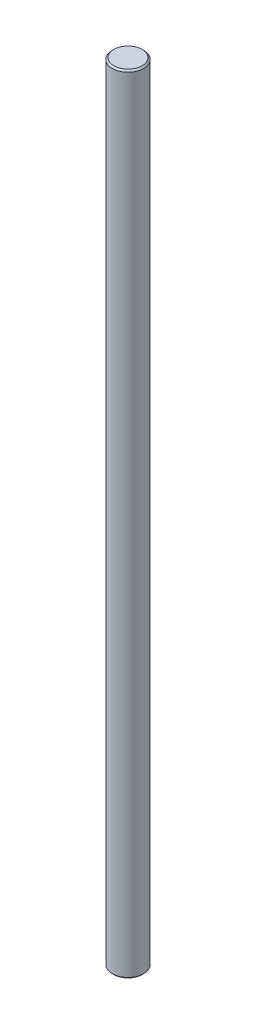
ISO-10303-21;
HEADER;
FILE_DESCRIPTION(('STEP AP214'),'2;1');
FILE_NAME('part.step','',(''),(''),'','','');
FILE_SCHEMA(('AUTOMOTIVE_DESIGN { 1 0 10303 214 1 1 1 1 }'));
ENDSEC;
DATA;
#1=APPLICATION_CONTEXT('core data for automotive mechanical design processes');
#2=APPLICATION_PROTOCOL_DEFINITION('international standard','automotive_design',2000,#1);
#3=PRODUCT_CONTEXT('',#1,'mechanical');
#4=PRODUCT('Part','Part','',(#3));
#5=PRODUCT_RELATED_PRODUCT_CATEGORY('part','',(#4));
#6=PRODUCT_DEFINITION_FORMATION('','',#4);
#7=PRODUCT_DEFINITION_CONTEXT('part definition',#1,'design');
#8=PRODUCT_DEFINITION('design','',#6,#7);
#9=PRODUCT_DEFINITION_SHAPE('','',#8);
#10=(LENGTH_UNIT() NAMED_UNIT(*) SI_UNIT(.MILLI.,.METRE.));
#11=(NAMED_UNIT(*) PLANE_ANGLE_UNIT() SI_UNIT($,.RADIAN.));
#12=(NAMED_UNIT(*) SI_UNIT($,.STERADIAN.) SOLID_ANGLE_UNIT());
#13=UNCERTAINTY_MEASURE_WITH_UNIT(LENGTH_MEASURE(1.E-05),#10,'distance_accuracy_value','');
#14=(GEOMETRIC_REPRESENTATION_CONTEXT(3) GLOBAL_UNCERTAINTY_ASSIGNED_CONTEXT((#13)) GLOBAL_UNIT_ASSIGNED_CONTEXT((#10,
#11,#12)) REPRESENTATION_CONTEXT('',''));
#15=CARTESIAN_POINT('',(0.,0.,0.));
#16=DIRECTION('',(0.,0.,1.));
#17=DIRECTION('',(1.,0.,0.));
#18=AXIS2_PLACEMENT_3D('',#15,#16,#17);
#19=CARTESIAN_POINT('',(0.,500.,0.));
#20=DIRECTION('',(0.,-1.,0.));
#21=DIRECTION('',(0.,0.,-1.));
#22=AXIS2_PLACEMENT_3D('',#19,#20,#21);
#23=CYLINDRICAL_SURFACE('',#22,10.);
#24=CARTESIAN_POINT('',(0.,499.,0.));
#25=DIRECTION('',(0.,1.,0.));
#26=DIRECTION('',(0.,0.,1.));
#27=AXIS2_PLACEMENT_3D('',#24,#25,#26);
#28=CIRCLE('',#27,10.);
#29=CARTESIAN_POINT('',(0.,499.,10.));
#30=VERTEX_POINT('',#29);
#31=EDGE_CURVE('E38',#30,#30,#28,.F.);
#32=ORIENTED_EDGE('',*,*,#31,.T.);
#33=EDGE_LOOP('',(#32));
#34=FACE_BOUND('',#33,.T.);
#35=CARTESIAN_POINT('',(0.,1.,0.));
#36=DIRECTION('',(0.,1.,0.));
#37=DIRECTION('',(0.,0.,1.));
#38=AXIS2_PLACEMENT_3D('',#35,#36,#37);
#39=CIRCLE('',#38,10.);
#40=CARTESIAN_POINT('',(0.,1.,10.));
#41=VERTEX_POINT('',#40);
#42=EDGE_CURVE('E42',#41,#41,#39,.T.);
#43=ORIENTED_EDGE('',*,*,#42,.T.);
#44=EDGE_LOOP('',(#43));
#45=FACE_BOUND('',#44,.T.);
#46=ADVANCED_FACE('F31',(#34,#45),#23,.T.);
#47=CARTESIAN_POINT('',(0.,500.,0.));
#48=DIRECTION('',(0.,1.,0.));
#49=DIRECTION('',(0.,0.,1.));
#50=AXIS2_PLACEMENT_3D('',#47,#48,#49);
#51=PLANE('',#50);
#52=CARTESIAN_POINT('',(0.,500.,0.));
#53=DIRECTION('',(0.,1.,0.));
#54=DIRECTION('',(0.,0.,1.));
#55=AXIS2_PLACEMENT_3D('',#52,#53,#54);
#56=CIRCLE('',#55,8.9999999999999);
#57=CARTESIAN_POINT('',(0.,500.,8.9999999999999));
#58=VERTEX_POINT('',#57);
#59=EDGE_CURVE('E46',#58,#58,#56,.T.);
#60=ORIENTED_EDGE('',*,*,#59,.T.);
#61=EDGE_LOOP('',(#60));
#62=FACE_BOUND('',#61,.T.);
#63=ADVANCED_FACE('F52',(#62),#51,.T.);
#64=CARTESIAN_POINT('',(0.,0.,0.));
#65=DIRECTION('',(0.,1.,0.));
#66=DIRECTION('',(0.,0.,1.));
#67=AXIS2_PLACEMENT_3D('',#64,#65,#66);
#68=PLANE('',#67);
#69=CARTESIAN_POINT('',(0.,0.,0.));
#70=DIRECTION('',(0.,1.,0.));
#71=DIRECTION('',(0.,0.,1.));
#72=AXIS2_PLACEMENT_3D('',#69,#70,#71);
#73=CIRCLE('',#72,9.00000000000001);
#74=CARTESIAN_POINT('',(0.,0.,9.00000000000001));
#75=VERTEX_POINT('',#74);
#76=EDGE_CURVE('E10',#75,#75,#73,.F.);
#77=ORIENTED_EDGE('',*,*,#76,.T.);
#78=EDGE_LOOP('',(#77));
#79=FACE_BOUND('',#78,.T.);
#80=ADVANCED_FACE('F56',(#79),#68,.F.);
#81=CARTESIAN_POINT('',(0.,500.,0.));
#82=DIRECTION('',(0.,-1.,0.));
#83=DIRECTION('',(0.,0.,-1.));
#84=AXIS2_PLACEMENT_3D('',#81,#82,#83);
#85=CONICAL_SURFACE('',#84,8.9999999999999,0.785398163397443);
#86=ORIENTED_EDGE('',*,*,#31,.F.);
#87=EDGE_LOOP('',(#86));
#88=FACE_BOUND('',#87,.T.);
#89=ORIENTED_EDGE('',*,*,#59,.F.);
#90=EDGE_LOOP('',(#89));
#91=FACE_BOUND('',#90,.T.);
#92=ADVANCED_FACE('F54',(#88,#91),#85,.T.);
#93=CARTESIAN_POINT('',(0.,1.,0.));
#94=DIRECTION('',(0.,1.,0.));
#95=DIRECTION('',(0.,0.,1.));
#96=AXIS2_PLACEMENT_3D('',#93,#94,#95);
#97=CONICAL_SURFACE('',#96,10.,0.785398163397443);
#98=ORIENTED_EDGE('',*,*,#76,.F.);
#99=EDGE_LOOP('',(#98));
#100=FACE_BOUND('',#99,.T.);
#101=ORIENTED_EDGE('',*,*,#42,.F.);
#102=EDGE_LOOP('',(#101));
#103=FACE_BOUND('',#102,.T.);
#104=ADVANCED_FACE('F33',(#100,#103),#97,.T.);
#105=CLOSED_SHELL('',(#46,#63,#80,#92,#104));
#106=MANIFOLD_SOLID_BREP('B2',#105);
#107=ADVANCED_BREP_SHAPE_REPRESENTATION('',(#18,#106),#14);
#108=SHAPE_DEFINITION_REPRESENTATION(#9,#107);
ENDSEC;
END-ISO-10303-21;
